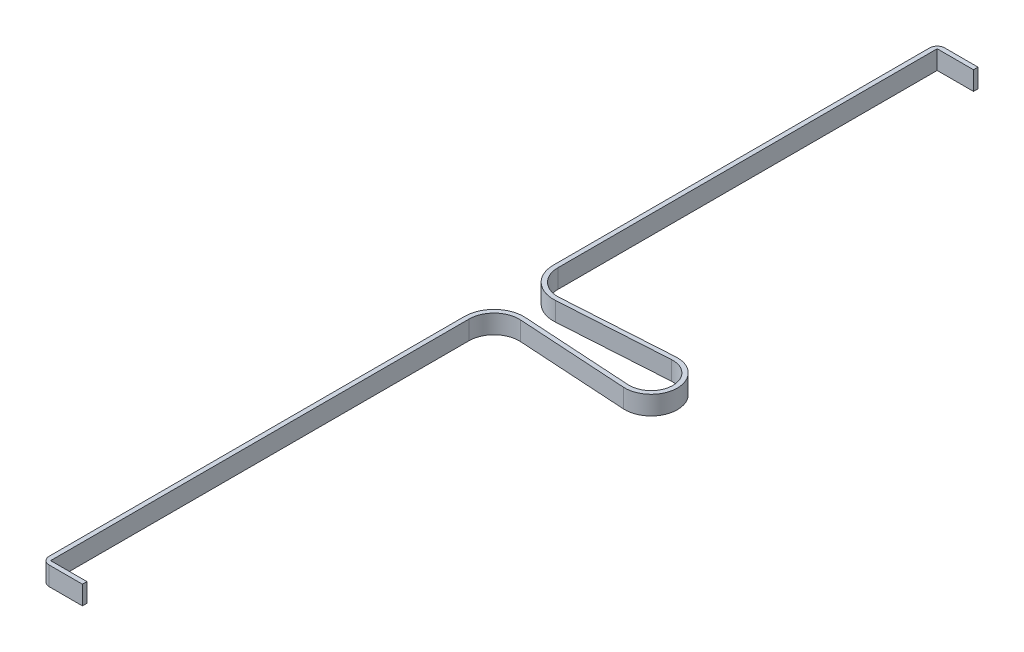
ISO-10303-21;
HEADER;
FILE_DESCRIPTION(('STEP AP214'),'2;1');
FILE_NAME('part.step','',(''),(''),'','','');
FILE_SCHEMA(('AUTOMOTIVE_DESIGN { 1 0 10303 214 1 1 1 1 }'));
ENDSEC;
DATA;
#1=APPLICATION_CONTEXT('core data for automotive mechanical design processes');
#2=APPLICATION_PROTOCOL_DEFINITION('international standard','automotive_design',2000,#1);
#3=PRODUCT_CONTEXT('',#1,'mechanical');
#4=PRODUCT('Part','Part','',(#3));
#5=PRODUCT_RELATED_PRODUCT_CATEGORY('part','',(#4));
#6=PRODUCT_DEFINITION_FORMATION('','',#4);
#7=PRODUCT_DEFINITION_CONTEXT('part definition',#1,'design');
#8=PRODUCT_DEFINITION('design','',#6,#7);
#9=PRODUCT_DEFINITION_SHAPE('','',#8);
#10=(LENGTH_UNIT() NAMED_UNIT(*) SI_UNIT(.MILLI.,.METRE.));
#11=(NAMED_UNIT(*) PLANE_ANGLE_UNIT() SI_UNIT($,.RADIAN.));
#12=(NAMED_UNIT(*) SI_UNIT($,.STERADIAN.) SOLID_ANGLE_UNIT());
#13=UNCERTAINTY_MEASURE_WITH_UNIT(LENGTH_MEASURE(1.E-05),#10,'distance_accuracy_value','');
#14=(GEOMETRIC_REPRESENTATION_CONTEXT(3) GLOBAL_UNCERTAINTY_ASSIGNED_CONTEXT((#13)) GLOBAL_UNIT_ASSIGNED_CONTEXT((#10,
#11,#12)) REPRESENTATION_CONTEXT('',''));
#15=CARTESIAN_POINT('',(0.,0.,0.));
#16=DIRECTION('',(0.,0.,1.));
#17=DIRECTION('',(1.,0.,0.));
#18=AXIS2_PLACEMENT_3D('',#15,#16,#17);
#19=CARTESIAN_POINT('',(35.3046748556602,3.175,-324.600000000124));
#20=DIRECTION('',(1.,0.,0.));
#21=DIRECTION('',(0.,0.,-1.));
#22=AXIS2_PLACEMENT_3D('',#19,#20,#21);
#23=PLANE('',#22);
#24=DIRECTION('',(0.,1.,0.));
#25=VECTOR('',#24,1.);
#26=CARTESIAN_POINT('',(35.3046748556602,3.175,-326.124000000124));
#27=LINE('',#26,#25);
#28=CARTESIAN_POINT('',(35.3046748556602,3.175,-326.124000000124));
#29=VERTEX_POINT('',#28);
#30=CARTESIAN_POINT('',(35.3046748556602,-3.175,-326.124000000124));
#31=VERTEX_POINT('',#30);
#32=EDGE_CURVE('E221',#29,#31,#27,.F.);
#33=ORIENTED_EDGE('',*,*,#32,.F.);
#34=DIRECTION('',(0.,0.,-1.));
#35=VECTOR('',#34,1.);
#36=CARTESIAN_POINT('',(35.3046748556602,3.175,-324.600000000124));
#37=LINE('',#36,#35);
#38=CARTESIAN_POINT('',(35.3046748556602,3.175,-324.600000000124));
#39=VERTEX_POINT('',#38);
#40=EDGE_CURVE('E347',#29,#39,#37,.F.);
#41=ORIENTED_EDGE('',*,*,#40,.T.);
#42=DIRECTION('',(0.,1.,0.));
#43=VECTOR('',#42,1.);
#44=CARTESIAN_POINT('',(35.3046748556602,3.175,-324.600000000124));
#45=LINE('',#44,#43);
#46=CARTESIAN_POINT('',(35.3046748556602,-3.175,-324.600000000124));
#47=VERTEX_POINT('',#46);
#48=EDGE_CURVE('E282',#47,#39,#45,.T.);
#49=ORIENTED_EDGE('',*,*,#48,.F.);
#50=DIRECTION('',(0.,0.,-1.));
#51=VECTOR('',#50,1.);
#52=CARTESIAN_POINT('',(35.3046748556602,-3.175,-324.600000000124));
#53=LINE('',#52,#51);
#54=EDGE_CURVE('E358',#47,#31,#53,.T.);
#55=ORIENTED_EDGE('',*,*,#54,.T.);
#56=EDGE_LOOP('',(#33,#41,#49,#55));
#57=FACE_BOUND('',#56,.T.);
#58=ADVANCED_FACE('F17',(#57),#23,.T.);
#59=CARTESIAN_POINT('',(21.522800000001,-3.175,-324.600000000124));
#60=DIRECTION('',(-1.,0.,0.));
#61=DIRECTION('',(0.,0.,1.));
#62=AXIS2_PLACEMENT_3D('',#59,#60,#61);
#63=PLANE('',#62);
#64=DIRECTION('',(0.,0.,1.));
#65=VECTOR('',#64,1.);
#66=CARTESIAN_POINT('',(21.522800000001,3.175,0.));
#67=LINE('',#66,#65);
#68=CARTESIAN_POINT('',(21.522800000001,3.175,-323.584000000124));
#69=VERTEX_POINT('',#68);
#70=CARTESIAN_POINT('',(21.5228000000048,3.175,-196.600000000001));
#71=VERTEX_POINT('',#70);
#72=EDGE_CURVE('E218',#69,#71,#67,.T.);
#73=ORIENTED_EDGE('',*,*,#72,.F.);
#74=DIRECTION('',(0.,-1.,0.));
#75=VECTOR('',#74,1.);
#76=CARTESIAN_POINT('',(21.522800000001,11.45286,-323.584000000124));
#77=LINE('',#76,#75);
#78=CARTESIAN_POINT('',(21.522800000001,-3.175,-323.584000000124));
#79=VERTEX_POINT('',#78);
#80=EDGE_CURVE('E212',#79,#69,#77,.F.);
#81=ORIENTED_EDGE('',*,*,#80,.F.);
#82=DIRECTION('',(0.,0.,1.));
#83=VECTOR('',#82,1.);
#84=CARTESIAN_POINT('',(21.522800000001,-3.175,0.));
#85=LINE('',#84,#83);
#86=CARTESIAN_POINT('',(21.5228000000048,-3.175,-196.600000000001));
#87=VERTEX_POINT('',#86);
#88=EDGE_CURVE('E215',#79,#87,#85,.T.);
#89=ORIENTED_EDGE('',*,*,#88,.T.);
#90=DIRECTION('',(0.,1.,0.));
#91=VECTOR('',#90,1.);
#92=CARTESIAN_POINT('',(21.5228000000086,-3.175,-196.600000000001));
#93=LINE('',#92,#91);
#94=EDGE_CURVE('E344',#71,#87,#93,.F.);
#95=ORIENTED_EDGE('',*,*,#94,.F.);
#96=EDGE_LOOP('',(#73,#81,#89,#95));
#97=FACE_BOUND('',#96,.T.);
#98=ADVANCED_FACE('F213',(#97),#63,.T.);
#99=CARTESIAN_POINT('',(31.5050000000086,-3.175,-196.600000000001));
#100=DIRECTION('',(0.,1.,0.));
#101=DIRECTION('',(0.,0.,1.));
#102=AXIS2_PLACEMENT_3D('',#99,#100,#101);
#103=CYLINDRICAL_SURFACE('',#102,9.9822);
#104=ORIENTED_EDGE('',*,*,#94,.T.);
#105=CARTESIAN_POINT('',(31.5050000000086,-3.175,-196.600000000001));
#106=DIRECTION('',(0.,1.,0.));
#107=DIRECTION('',(0.,0.,1.));
#108=AXIS2_PLACEMENT_3D('',#105,#106,#107);
#109=CIRCLE('',#108,9.9822);
#110=CARTESIAN_POINT('',(32.1250651510475,-3.175,-186.637076932517));
#111=VERTEX_POINT('',#110);
#112=EDGE_CURVE('E232',#87,#111,#109,.T.);
#113=ORIENTED_EDGE('',*,*,#112,.T.);
#114=DIRECTION('',(0.,1.,0.));
#115=VECTOR('',#114,1.);
#116=CARTESIAN_POINT('',(32.1250651510366,-3.175,-186.637076932516));
#117=LINE('',#116,#115);
#118=CARTESIAN_POINT('',(32.1250651510475,3.175,-186.637076932517));
#119=VERTEX_POINT('',#118);
#120=EDGE_CURVE('E340',#119,#111,#117,.F.);
#121=ORIENTED_EDGE('',*,*,#120,.F.);
#122=CARTESIAN_POINT('',(31.5050000000086,3.175,-196.600000000001));
#123=DIRECTION('',(0.,1.,0.));
#124=DIRECTION('',(0.,0.,1.));
#125=AXIS2_PLACEMENT_3D('',#122,#123,#124);
#126=CIRCLE('',#125,9.9822);
#127=EDGE_CURVE('E400',#71,#119,#126,.T.);
#128=ORIENTED_EDGE('',*,*,#127,.F.);
#129=EDGE_LOOP('',(#104,#113,#121,#128));
#130=FACE_BOUND('',#129,.T.);
#131=ADVANCED_FACE('F613',(#130),#103,.T.);
#132=CARTESIAN_POINT('',(32.1250651510366,-3.175,-186.637076932516));
#133=DIRECTION('',(0.0621170835135079,0.,0.998068869335065));
#134=DIRECTION('',(0.998068869335065,0.,-0.0621170835135079));
#135=AXIS2_PLACEMENT_3D('',#132,#133,#134);
#136=PLANE('',#135);
#137=ORIENTED_EDGE('',*,*,#120,.T.);
#138=DIRECTION('',(0.99806886933506,0.,-0.0621170835135969));
#139=VECTOR('',#138,1.);
#140=CARTESIAN_POINT('',(32.1250651510366,-3.175,-186.637076932516));
#141=LINE('',#140,#139);
#142=CARTESIAN_POINT('',(69.0484840229799,-3.175,-188.935089789295));
#143=VERTEX_POINT('',#142);
#144=EDGE_CURVE('E239',#111,#143,#141,.T.);
#145=ORIENTED_EDGE('',*,*,#144,.T.);
#146=DIRECTION('',(0.,1.,0.));
#147=VECTOR('',#146,1.);
#148=CARTESIAN_POINT('',(69.0484840229734,-3.175,-188.935089789301));
#149=LINE('',#148,#147);
#150=CARTESIAN_POINT('',(69.0484840229799,3.175,-188.935089789295));
#151=VERTEX_POINT('',#150);
#152=EDGE_CURVE('E337',#143,#151,#149,.T.);
#153=ORIENTED_EDGE('',*,*,#152,.T.);
#154=DIRECTION('',(0.99806886933506,0.,-0.0621170835135969));
#155=VECTOR('',#154,1.);
#156=CARTESIAN_POINT('',(32.1250651510366,3.175,-186.637076932516));
#157=LINE('',#156,#155);
#158=EDGE_CURVE('E399',#119,#151,#157,.T.);
#159=ORIENTED_EDGE('',*,*,#158,.F.);
#160=EDGE_LOOP('',(#137,#145,#153,#159));
#161=FACE_BOUND('',#160,.T.);
#162=ADVANCED_FACE('F430',(#161),#136,.T.);
#163=CARTESIAN_POINT('',(69.505000000009,-3.175,-181.60000000001));
#164=DIRECTION('',(0.,1.,0.));
#165=DIRECTION('',(0.,0.,1.));
#166=AXIS2_PLACEMENT_3D('',#163,#164,#165);
#167=CYLINDRICAL_SURFACE('',#166,7.34928221353978);
#168=CARTESIAN_POINT('',(69.505000000009,3.175,-181.60000000001));
#169=DIRECTION('',(0.,1.,0.));
#170=DIRECTION('',(0.,0.,1.));
#171=AXIS2_PLACEMENT_3D('',#168,#169,#170);
#172=CIRCLE('',#171,7.34928221353978);
#173=CARTESIAN_POINT('',(69.0484840229795,3.175,-174.264910210706));
#174=VERTEX_POINT('',#173);
#175=EDGE_CURVE('E395',#151,#174,#172,.F.);
#176=ORIENTED_EDGE('',*,*,#175,.F.);
#177=ORIENTED_EDGE('',*,*,#152,.F.);
#178=CARTESIAN_POINT('',(69.505000000009,-3.175,-181.60000000001));
#179=DIRECTION('',(0.,1.,0.));
#180=DIRECTION('',(0.,0.,1.));
#181=AXIS2_PLACEMENT_3D('',#178,#179,#180);
#182=CIRCLE('',#181,7.34928221353978);
#183=CARTESIAN_POINT('',(69.0484840229795,-3.175,-174.264910210706));
#184=VERTEX_POINT('',#183);
#185=EDGE_CURVE('E421',#143,#184,#182,.F.);
#186=ORIENTED_EDGE('',*,*,#185,.T.);
#187=DIRECTION('',(0.,1.,0.));
#188=VECTOR('',#187,1.);
#189=CARTESIAN_POINT('',(69.0484840229742,-3.175,-174.264910210707));
#190=LINE('',#189,#188);
#191=EDGE_CURVE('E333',#174,#184,#190,.F.);
#192=ORIENTED_EDGE('',*,*,#191,.F.);
#193=EDGE_LOOP('',(#176,#177,#186,#192));
#194=FACE_BOUND('',#193,.T.);
#195=ADVANCED_FACE('F433',(#194),#167,.F.);
#196=CARTESIAN_POINT('',(69.0484840229742,-3.175,-174.264910210707));
#197=DIRECTION('',(0.0621170835135079,0.,-0.998068869335065));
#198=DIRECTION('',(-0.998068869335065,0.,-0.0621170835135079));
#199=AXIS2_PLACEMENT_3D('',#196,#197,#198);
#200=PLANE('',#199);
#201=ORIENTED_EDGE('',*,*,#191,.T.);
#202=DIRECTION('',(-0.99806886933506,0.,-0.0621170835135962));
#203=VECTOR('',#202,1.);
#204=CARTESIAN_POINT('',(69.0484840229742,-3.175,-174.264910210707));
#205=LINE('',#204,#203);
#206=CARTESIAN_POINT('',(32.1250651510473,-3.175,-176.562923067475));
#207=VERTEX_POINT('',#206);
#208=EDGE_CURVE('E420',#184,#207,#205,.T.);
#209=ORIENTED_EDGE('',*,*,#208,.T.);
#210=DIRECTION('',(0.,1.,0.));
#211=VECTOR('',#210,1.);
#212=CARTESIAN_POINT('',(32.1250651510362,-3.175,-176.562923067472));
#213=LINE('',#212,#211);
#214=CARTESIAN_POINT('',(32.1250651510473,3.175,-176.562923067475));
#215=VERTEX_POINT('',#214);
#216=EDGE_CURVE('E329',#215,#207,#213,.F.);
#217=ORIENTED_EDGE('',*,*,#216,.F.);
#218=DIRECTION('',(-0.99806886933506,0.,-0.0621170835135962));
#219=VECTOR('',#218,1.);
#220=CARTESIAN_POINT('',(69.0484840229742,3.175,-174.264910210707));
#221=LINE('',#220,#219);
#222=EDGE_CURVE('E394',#174,#215,#221,.T.);
#223=ORIENTED_EDGE('',*,*,#222,.F.);
#224=EDGE_LOOP('',(#201,#209,#217,#223));
#225=FACE_BOUND('',#224,.T.);
#226=ADVANCED_FACE('F439',(#225),#200,.T.);
#227=CARTESIAN_POINT('',(31.5050000000086,-3.175,-166.599999999994));
#228=DIRECTION('',(0.,1.,0.));
#229=DIRECTION('',(0.,0.,1.));
#230=AXIS2_PLACEMENT_3D('',#227,#228,#229);
#231=CYLINDRICAL_SURFACE('',#230,9.9822);
#232=ORIENTED_EDGE('',*,*,#216,.T.);
#233=CARTESIAN_POINT('',(31.5050000000086,-3.175,-166.599999999994));
#234=DIRECTION('',(0.,1.,0.));
#235=DIRECTION('',(0.,0.,1.));
#236=AXIS2_PLACEMENT_3D('',#233,#234,#235);
#237=CIRCLE('',#236,9.9822);
#238=CARTESIAN_POINT('',(21.522800000001,-3.175,-166.599999999994));
#239=VERTEX_POINT('',#238);
#240=EDGE_CURVE('E417',#207,#239,#237,.T.);
#241=ORIENTED_EDGE('',*,*,#240,.T.);
#242=DIRECTION('',(0.,1.,0.));
#243=VECTOR('',#242,1.);
#244=CARTESIAN_POINT('',(21.522800000001,-3.175,-166.599999999994));
#245=LINE('',#244,#243);
#246=CARTESIAN_POINT('',(21.522800000001,3.175,-166.599999999994));
#247=VERTEX_POINT('',#246);
#248=EDGE_CURVE('E325',#247,#239,#245,.F.);
#249=ORIENTED_EDGE('',*,*,#248,.F.);
#250=CARTESIAN_POINT('',(31.5050000000086,3.175,-166.599999999994));
#251=DIRECTION('',(0.,1.,0.));
#252=DIRECTION('',(0.,0.,1.));
#253=AXIS2_PLACEMENT_3D('',#250,#251,#252);
#254=CIRCLE('',#253,9.9822);
#255=EDGE_CURVE('E390',#215,#247,#254,.T.);
#256=ORIENTED_EDGE('',*,*,#255,.F.);
#257=EDGE_LOOP('',(#232,#241,#249,#256));
#258=FACE_BOUND('',#257,.T.);
#259=ADVANCED_FACE('F443',(#258),#231,.T.);
#260=CARTESIAN_POINT('',(21.522800000001,-3.175,-166.599999999994));
#261=DIRECTION('',(-1.,0.,0.));
#262=DIRECTION('',(0.,0.,1.));
#263=AXIS2_PLACEMENT_3D('',#260,#261,#262);
#264=PLANE('',#263);
#265=DIRECTION('',(0.,0.,1.));
#266=VECTOR('',#265,1.);
#267=CARTESIAN_POINT('',(21.522800000001,-3.175,0.));
#268=LINE('',#267,#266);
#269=CARTESIAN_POINT('',(21.522800000001,-3.175,-26.416));
#270=VERTEX_POINT('',#269);
#271=EDGE_CURVE('E416',#239,#270,#268,.T.);
#272=ORIENTED_EDGE('',*,*,#271,.T.);
#273=DIRECTION('',(0.,-1.,0.));
#274=VECTOR('',#273,1.);
#275=CARTESIAN_POINT('',(21.522800000001,11.45286,-26.416));
#276=LINE('',#275,#274);
#277=CARTESIAN_POINT('',(21.522800000001,3.175,-26.416));
#278=VERTEX_POINT('',#277);
#279=EDGE_CURVE('E321',#278,#270,#276,.T.);
#280=ORIENTED_EDGE('',*,*,#279,.F.);
#281=DIRECTION('',(0.,0.,1.));
#282=VECTOR('',#281,1.);
#283=CARTESIAN_POINT('',(21.522800000001,3.175,0.));
#284=LINE('',#283,#282);
#285=EDGE_CURVE('E389',#247,#278,#284,.T.);
#286=ORIENTED_EDGE('',*,*,#285,.F.);
#287=ORIENTED_EDGE('',*,*,#248,.T.);
#288=EDGE_LOOP('',(#272,#280,#286,#287));
#289=FACE_BOUND('',#288,.T.);
#290=ADVANCED_FACE('F496',(#289),#264,.T.);
#291=CARTESIAN_POINT('',(24.062800000001,11.45286,-26.416));
#292=DIRECTION('',(0.,-1.,0.));
#293=DIRECTION('',(0.,0.,-1.));
#294=AXIS2_PLACEMENT_3D('',#291,#292,#293);
#295=CYLINDRICAL_SURFACE('',#294,2.54);
#296=ORIENTED_EDGE('',*,*,#279,.T.);
#297=CARTESIAN_POINT('',(24.062800000001,-3.175,-26.416));
#298=DIRECTION('',(0.,-1.,0.));
#299=DIRECTION('',(0.,0.,-1.));
#300=AXIS2_PLACEMENT_3D('',#297,#298,#299);
#301=CIRCLE('',#300,2.54);
#302=CARTESIAN_POINT('',(24.062800000001,-3.175,-23.876));
#303=VERTEX_POINT('',#302);
#304=EDGE_CURVE('E413',#270,#303,#301,.F.);
#305=ORIENTED_EDGE('',*,*,#304,.T.);
#306=DIRECTION('',(0.,1.,0.));
#307=VECTOR('',#306,1.);
#308=CARTESIAN_POINT('',(24.062800000001,3.175,-23.876));
#309=LINE('',#308,#307);
#310=CARTESIAN_POINT('',(24.062800000001,3.175,-23.876));
#311=VERTEX_POINT('',#310);
#312=EDGE_CURVE('E307',#311,#303,#309,.F.);
#313=ORIENTED_EDGE('',*,*,#312,.F.);
#314=CARTESIAN_POINT('',(24.062800000001,3.175,-26.416));
#315=DIRECTION('',(0.,-1.,0.));
#316=DIRECTION('',(0.,0.,-1.));
#317=AXIS2_PLACEMENT_3D('',#314,#315,#316);
#318=CIRCLE('',#317,2.54);
#319=EDGE_CURVE('E385',#278,#311,#318,.F.);
#320=ORIENTED_EDGE('',*,*,#319,.F.);
#321=EDGE_LOOP('',(#296,#305,#313,#320));
#322=FACE_BOUND('',#321,.T.);
#323=ADVANCED_FACE('F500',(#322),#295,.T.);
#324=CARTESIAN_POINT('',(21.522800000001,3.175,-23.876));
#325=DIRECTION('',(0.,0.,1.));
#326=DIRECTION('',(1.,0.,0.));
#327=AXIS2_PLACEMENT_3D('',#324,#325,#326);
#328=PLANE('',#327);
#329=DIRECTION('',(1.,0.,0.));
#330=VECTOR('',#329,1.);
#331=CARTESIAN_POINT('',(0.,3.175,-23.876));
#332=LINE('',#331,#330);
#333=CARTESIAN_POINT('',(35.3046748556602,3.175,-23.876));
#334=VERTEX_POINT('',#333);
#335=EDGE_CURVE('E267',#311,#334,#332,.T.);
#336=ORIENTED_EDGE('',*,*,#335,.F.);
#337=ORIENTED_EDGE('',*,*,#312,.T.);
#338=DIRECTION('',(1.,0.,0.));
#339=VECTOR('',#338,1.);
#340=CARTESIAN_POINT('',(0.,-3.175,-23.876));
#341=LINE('',#340,#339);
#342=CARTESIAN_POINT('',(35.3046748556602,-3.175,-23.876));
#343=VERTEX_POINT('',#342);
#344=EDGE_CURVE('E255',#303,#343,#341,.T.);
#345=ORIENTED_EDGE('',*,*,#344,.T.);
#346=DIRECTION('',(0.,1.,0.));
#347=VECTOR('',#346,1.);
#348=CARTESIAN_POINT('',(35.3046748556602,3.175,-23.876));
#349=LINE('',#348,#347);
#350=EDGE_CURVE('E228',#334,#343,#349,.F.);
#351=ORIENTED_EDGE('',*,*,#350,.F.);
#352=EDGE_LOOP('',(#336,#337,#345,#351));
#353=FACE_BOUND('',#352,.T.);
#354=ADVANCED_FACE('F506',(#353),#328,.T.);
#355=CARTESIAN_POINT('',(32.0284176138266,-3.175,-175.041989175647));
#356=DIRECTION('',(-0.0618828608721009,0.,0.998083419124015));
#357=DIRECTION('',(0.998083419124015,0.,0.0618828608721009));
#358=AXIS2_PLACEMENT_3D('',#355,#356,#357);
#359=PLANE('',#358);
#360=DIRECTION('',(0.,1.,0.));
#361=VECTOR('',#360,1.);
#362=CARTESIAN_POINT('',(32.0284176138255,-3.175,-175.041989175629));
#363=LINE('',#362,#361);
#364=CARTESIAN_POINT('',(32.0284176138341,3.175,-175.041989175638));
#365=VERTEX_POINT('',#364);
#366=CARTESIAN_POINT('',(32.0284176138341,-3.175,-175.041989175638));
#367=VERTEX_POINT('',#366);
#368=EDGE_CURVE('E308',#365,#367,#363,.F.);
#369=ORIENTED_EDGE('',*,*,#368,.T.);
#370=DIRECTION('',(0.998083419123981,0.,0.0618828608726443));
#371=VECTOR('',#370,1.);
#372=CARTESIAN_POINT('',(32.0284176138266,-3.175,-175.041989175647));
#373=LINE('',#372,#371);
#374=CARTESIAN_POINT('',(68.9564331915117,-3.175,-172.752389722834));
#375=VERTEX_POINT('',#374);
#376=EDGE_CURVE('E254',#367,#375,#373,.T.);
#377=ORIENTED_EDGE('',*,*,#376,.T.);
#378=DIRECTION('',(0.,1.,0.));
#379=VECTOR('',#378,1.);
#380=CARTESIAN_POINT('',(68.9564331915072,-3.175,-172.752389722844));
#381=LINE('',#380,#379);
#382=CARTESIAN_POINT('',(68.9564331915117,3.175,-172.752389722834));
#383=VERTEX_POINT('',#382);
#384=EDGE_CURVE('E303',#383,#375,#381,.F.);
#385=ORIENTED_EDGE('',*,*,#384,.F.);
#386=DIRECTION('',(0.998083419123981,0.,0.0618828608726443));
#387=VECTOR('',#386,1.);
#388=CARTESIAN_POINT('',(32.0284176138266,3.175,-175.041989175647));
#389=LINE('',#388,#387);
#390=EDGE_CURVE('E381',#365,#383,#389,.T.);
#391=ORIENTED_EDGE('',*,*,#390,.F.);
#392=EDGE_LOOP('',(#369,#377,#385,#391));
#393=FACE_BOUND('',#392,.T.);
#394=ADVANCED_FACE('F560',(#393),#359,.T.);
#395=CARTESIAN_POINT('',(69.505000000009,-3.175,-181.60000000001));
#396=DIRECTION('',(0.,1.,0.));
#397=DIRECTION('',(0.,0.,1.));
#398=AXIS2_PLACEMENT_3D('',#395,#396,#397);
#399=CYLINDRICAL_SURFACE('',#398,8.8646);
#400=ORIENTED_EDGE('',*,*,#384,.T.);
#401=CARTESIAN_POINT('',(69.505000000009,-3.175,-181.60000000001));
#402=DIRECTION('',(0.,1.,0.));
#403=DIRECTION('',(0.,0.,1.));
#404=AXIS2_PLACEMENT_3D('',#401,#402,#403);
#405=CIRCLE('',#404,8.8646);
#406=CARTESIAN_POINT('',(68.9564331915149,-3.175,-190.44761027717));
#407=VERTEX_POINT('',#406);
#408=EDGE_CURVE('E410',#375,#407,#405,.T.);
#409=ORIENTED_EDGE('',*,*,#408,.T.);
#410=DIRECTION('',(0.,1.,0.));
#411=VECTOR('',#410,1.);
#412=CARTESIAN_POINT('',(68.956433191506,-3.175,-190.44761027717));
#413=LINE('',#412,#411);
#414=CARTESIAN_POINT('',(68.9564331915149,3.175,-190.44761027717));
#415=VERTEX_POINT('',#414);
#416=EDGE_CURVE('E299',#415,#407,#413,.F.);
#417=ORIENTED_EDGE('',*,*,#416,.F.);
#418=CARTESIAN_POINT('',(69.505000000009,3.175,-181.60000000001));
#419=DIRECTION('',(0.,1.,0.));
#420=DIRECTION('',(0.,0.,1.));
#421=AXIS2_PLACEMENT_3D('',#418,#419,#420);
#422=CIRCLE('',#421,8.8646);
#423=EDGE_CURVE('E377',#383,#415,#422,.T.);
#424=ORIENTED_EDGE('',*,*,#423,.F.);
#425=EDGE_LOOP('',(#400,#409,#417,#424));
#426=FACE_BOUND('',#425,.T.);
#427=ADVANCED_FACE('F554',(#426),#399,.T.);
#428=CARTESIAN_POINT('',(68.956433191506,-3.175,-190.44761027717));
#429=DIRECTION('',(-0.0618828608721009,0.,-0.998083419124015));
#430=DIRECTION('',(-0.998083419124015,0.,0.0618828608721009));
#431=AXIS2_PLACEMENT_3D('',#428,#429,#430);
#432=PLANE('',#431);
#433=ORIENTED_EDGE('',*,*,#416,.T.);
#434=DIRECTION('',(-0.998083419124024,0.,0.0618828608719605));
#435=VECTOR('',#434,1.);
#436=CARTESIAN_POINT('',(68.956433191506,-3.175,-190.44761027717));
#437=LINE('',#436,#435);
#438=CARTESIAN_POINT('',(32.0284176138312,-3.175,-188.15801082437));
#439=VERTEX_POINT('',#438);
#440=EDGE_CURVE('E409',#407,#439,#437,.T.);
#441=ORIENTED_EDGE('',*,*,#440,.T.);
#442=DIRECTION('',(0.,1.,0.));
#443=VECTOR('',#442,1.);
#444=CARTESIAN_POINT('',(32.0284176138271,-3.175,-188.158010824366));
#445=LINE('',#444,#443);
#446=CARTESIAN_POINT('',(32.0284176138312,3.175,-188.15801082437));
#447=VERTEX_POINT('',#446);
#448=EDGE_CURVE('E283',#439,#447,#445,.T.);
#449=ORIENTED_EDGE('',*,*,#448,.T.);
#450=DIRECTION('',(-0.998083419124024,0.,0.0618828608719605));
#451=VECTOR('',#450,1.);
#452=CARTESIAN_POINT('',(68.956433191506,3.175,-190.44761027717));
#453=LINE('',#452,#451);
#454=EDGE_CURVE('E376',#415,#447,#453,.T.);
#455=ORIENTED_EDGE('',*,*,#454,.F.);
#456=EDGE_LOOP('',(#433,#441,#449,#455));
#457=FACE_BOUND('',#456,.T.);
#458=ADVANCED_FACE('F551',(#457),#432,.T.);
#459=CARTESIAN_POINT('',(31.5050000000086,-3.175,-196.600000000001));
#460=DIRECTION('',(0.,1.,0.));
#461=DIRECTION('',(0.,0.,1.));
#462=AXIS2_PLACEMENT_3D('',#459,#460,#461);
#463=CYLINDRICAL_SURFACE('',#462,8.4582);
#464=CARTESIAN_POINT('',(31.5050000000086,3.175,-196.600000000001));
#465=DIRECTION('',(0.,1.,0.));
#466=DIRECTION('',(0.,0.,1.));
#467=AXIS2_PLACEMENT_3D('',#464,#465,#466);
#468=CIRCLE('',#467,8.4582);
#469=CARTESIAN_POINT('',(23.046800000001,3.175,-196.600000000001));
#470=VERTEX_POINT('',#469);
#471=EDGE_CURVE('E373',#447,#470,#468,.F.);
#472=ORIENTED_EDGE('',*,*,#471,.F.);
#473=ORIENTED_EDGE('',*,*,#448,.F.);
#474=CARTESIAN_POINT('',(31.5050000000086,-3.175,-196.600000000001));
#475=DIRECTION('',(0.,1.,0.));
#476=DIRECTION('',(0.,0.,1.));
#477=AXIS2_PLACEMENT_3D('',#474,#475,#476);
#478=CIRCLE('',#477,8.4582);
#479=CARTESIAN_POINT('',(23.046800000001,-3.175,-196.600000000001));
#480=VERTEX_POINT('',#479);
#481=EDGE_CURVE('E406',#439,#480,#478,.F.);
#482=ORIENTED_EDGE('',*,*,#481,.T.);
#483=DIRECTION('',(0.,1.,0.));
#484=VECTOR('',#483,1.);
#485=CARTESIAN_POINT('',(23.046800000001,-3.175,-196.600000000001));
#486=LINE('',#485,#484);
#487=EDGE_CURVE('E278',#470,#480,#486,.F.);
#488=ORIENTED_EDGE('',*,*,#487,.F.);
#489=EDGE_LOOP('',(#472,#473,#482,#488));
#490=FACE_BOUND('',#489,.T.);
#491=ADVANCED_FACE('F548',(#490),#463,.F.);
#492=CARTESIAN_POINT('',(23.046800000001,-3.175,-196.600000000001));
#493=DIRECTION('',(1.,0.,0.));
#494=DIRECTION('',(0.,0.,-1.));
#495=AXIS2_PLACEMENT_3D('',#492,#493,#494);
#496=PLANE('',#495);
#497=DIRECTION('',(0.,0.,1.));
#498=VECTOR('',#497,1.);
#499=CARTESIAN_POINT('',(23.046800000001,-3.175,0.));
#500=LINE('',#499,#498);
#501=CARTESIAN_POINT('',(23.046800000001,-3.175,-324.600000000124));
#502=VERTEX_POINT('',#501);
#503=EDGE_CURVE('E353',#480,#502,#500,.F.);
#504=ORIENTED_EDGE('',*,*,#503,.T.);
#505=DIRECTION('',(0.,1.,0.));
#506=VECTOR('',#505,1.);
#507=CARTESIAN_POINT('',(23.046800000001,3.175,-324.600000000124));
#508=LINE('',#507,#506);
#509=CARTESIAN_POINT('',(23.046800000001,3.175,-324.600000000124));
#510=VERTEX_POINT('',#509);
#511=EDGE_CURVE('E275',#510,#502,#508,.F.);
#512=ORIENTED_EDGE('',*,*,#511,.F.);
#513=DIRECTION('',(0.,0.,1.));
#514=VECTOR('',#513,1.);
#515=CARTESIAN_POINT('',(23.046800000001,3.175,0.));
#516=LINE('',#515,#514);
#517=EDGE_CURVE('E289',#470,#510,#516,.F.);
#518=ORIENTED_EDGE('',*,*,#517,.F.);
#519=ORIENTED_EDGE('',*,*,#487,.T.);
#520=EDGE_LOOP('',(#504,#512,#518,#519));
#521=FACE_BOUND('',#520,.T.);
#522=ADVANCED_FACE('F541',(#521),#496,.T.);
#523=CARTESIAN_POINT('',(21.522800000001,3.175,-324.600000000124));
#524=DIRECTION('',(0.,0.,1.));
#525=DIRECTION('',(1.,0.,0.));
#526=AXIS2_PLACEMENT_3D('',#523,#524,#525);
#527=PLANE('',#526);
#528=DIRECTION('',(1.,0.,0.));
#529=VECTOR('',#528,1.);
#530=CARTESIAN_POINT('',(0.,3.175,-324.600000000124));
#531=LINE('',#530,#529);
#532=EDGE_CURVE('E284',#510,#39,#531,.T.);
#533=ORIENTED_EDGE('',*,*,#532,.F.);
#534=ORIENTED_EDGE('',*,*,#511,.T.);
#535=DIRECTION('',(1.,0.,0.));
#536=VECTOR('',#535,1.);
#537=CARTESIAN_POINT('',(0.,-3.175,-324.600000000124));
#538=LINE('',#537,#536);
#539=EDGE_CURVE('E348',#502,#47,#538,.T.);
#540=ORIENTED_EDGE('',*,*,#539,.T.);
#541=ORIENTED_EDGE('',*,*,#48,.T.);
#542=EDGE_LOOP('',(#533,#534,#540,#541));
#543=FACE_BOUND('',#542,.T.);
#544=ADVANCED_FACE('F538',(#543),#527,.T.);
#545=CARTESIAN_POINT('',(35.3046748556602,3.175,-326.124000000124));
#546=DIRECTION('',(0.,0.,-1.));
#547=DIRECTION('',(-1.,0.,0.));
#548=AXIS2_PLACEMENT_3D('',#545,#546,#547);
#549=PLANE('',#548);
#550=DIRECTION('',(1.,0.,0.));
#551=VECTOR('',#550,1.);
#552=CARTESIAN_POINT('',(0.,-3.175,-326.124000000124));
#553=LINE('',#552,#551);
#554=CARTESIAN_POINT('',(24.062800000001,-3.175,-326.124000000124));
#555=VERTEX_POINT('',#554);
#556=EDGE_CURVE('E352',#31,#555,#553,.F.);
#557=ORIENTED_EDGE('',*,*,#556,.T.);
#558=DIRECTION('',(0.,-1.,0.));
#559=VECTOR('',#558,1.);
#560=CARTESIAN_POINT('',(24.062800000001,11.45286,-326.124000000124));
#561=LINE('',#560,#559);
#562=CARTESIAN_POINT('',(24.062800000001,3.175,-326.124000000124));
#563=VERTEX_POINT('',#562);
#564=EDGE_CURVE('E207',#563,#555,#561,.T.);
#565=ORIENTED_EDGE('',*,*,#564,.F.);
#566=DIRECTION('',(1.,0.,0.));
#567=VECTOR('',#566,1.);
#568=CARTESIAN_POINT('',(0.,3.175,-326.124000000124));
#569=LINE('',#568,#567);
#570=EDGE_CURVE('E288',#29,#563,#569,.F.);
#571=ORIENTED_EDGE('',*,*,#570,.F.);
#572=ORIENTED_EDGE('',*,*,#32,.T.);
#573=EDGE_LOOP('',(#557,#565,#571,#572));
#574=FACE_BOUND('',#573,.T.);
#575=ADVANCED_FACE('F531',(#574),#549,.T.);
#576=CARTESIAN_POINT('',(24.062800000001,11.45286,-323.584000000124));
#577=DIRECTION('',(0.,-1.,0.));
#578=DIRECTION('',(0.,0.,-1.));
#579=AXIS2_PLACEMENT_3D('',#576,#577,#578);
#580=CYLINDRICAL_SURFACE('',#579,2.54);
#581=ORIENTED_EDGE('',*,*,#564,.T.);
#582=CARTESIAN_POINT('',(24.062800000001,-3.175,-323.584000000124));
#583=DIRECTION('',(0.,-1.,0.));
#584=DIRECTION('',(0.,0.,-1.));
#585=AXIS2_PLACEMENT_3D('',#582,#583,#584);
#586=CIRCLE('',#585,2.54);
#587=EDGE_CURVE('E20',#555,#79,#586,.F.);
#588=ORIENTED_EDGE('',*,*,#587,.T.);
#589=ORIENTED_EDGE('',*,*,#80,.T.);
#590=CARTESIAN_POINT('',(24.062800000001,3.175,-323.584000000124));
#591=DIRECTION('',(0.,-1.,0.));
#592=DIRECTION('',(0.,0.,-1.));
#593=AXIS2_PLACEMENT_3D('',#590,#591,#592);
#594=CIRCLE('',#593,2.54);
#595=EDGE_CURVE('E370',#563,#69,#594,.F.);
#596=ORIENTED_EDGE('',*,*,#595,.F.);
#597=EDGE_LOOP('',(#581,#588,#589,#596));
#598=FACE_BOUND('',#597,.T.);
#599=ADVANCED_FACE('F224',(#598),#580,.T.);
#600=CARTESIAN_POINT('',(35.3046748556602,3.175,-23.876));
#601=DIRECTION('',(1.,0.,0.));
#602=DIRECTION('',(0.,0.,-1.));
#603=AXIS2_PLACEMENT_3D('',#600,#601,#602);
#604=PLANE('',#603);
#605=DIRECTION('',(0.,1.,0.));
#606=VECTOR('',#605,1.);
#607=CARTESIAN_POINT('',(35.3046748556602,3.175,-25.4));
#608=LINE('',#607,#606);
#609=CARTESIAN_POINT('',(35.3046748556602,3.175,-25.4));
#610=VERTEX_POINT('',#609);
#611=CARTESIAN_POINT('',(35.3046748556602,-3.175,-25.4));
#612=VERTEX_POINT('',#611);
#613=EDGE_CURVE('E248',#610,#612,#608,.F.);
#614=ORIENTED_EDGE('',*,*,#613,.F.);
#615=DIRECTION('',(0.,0.,1.));
#616=VECTOR('',#615,1.);
#617=CARTESIAN_POINT('',(35.3046748556602,3.175,0.));
#618=LINE('',#617,#616);
#619=EDGE_CURVE('E263',#334,#610,#618,.F.);
#620=ORIENTED_EDGE('',*,*,#619,.F.);
#621=ORIENTED_EDGE('',*,*,#350,.T.);
#622=DIRECTION('',(0.,0.,1.));
#623=VECTOR('',#622,1.);
#624=CARTESIAN_POINT('',(35.3046748556602,-3.175,0.));
#625=LINE('',#624,#623);
#626=EDGE_CURVE('E251',#343,#612,#625,.F.);
#627=ORIENTED_EDGE('',*,*,#626,.T.);
#628=EDGE_LOOP('',(#614,#620,#621,#627));
#629=FACE_BOUND('',#628,.T.);
#630=ADVANCED_FACE('F510',(#629),#604,.T.);
#631=CARTESIAN_POINT('',(0.,-3.175,0.));
#632=DIRECTION('',(0.,1.,0.));
#633=DIRECTION('',(0.,0.,1.));
#634=AXIS2_PLACEMENT_3D('',#631,#632,#633);
#635=PLANE('',#634);
#636=ORIENTED_EDGE('',*,*,#54,.F.);
#637=ORIENTED_EDGE('',*,*,#539,.F.);
#638=ORIENTED_EDGE('',*,*,#503,.F.);
#639=ORIENTED_EDGE('',*,*,#481,.F.);
#640=ORIENTED_EDGE('',*,*,#440,.F.);
#641=ORIENTED_EDGE('',*,*,#408,.F.);
#642=ORIENTED_EDGE('',*,*,#376,.F.);
#643=CARTESIAN_POINT('',(31.5050000000086,-3.175,-166.599999999994));
#644=DIRECTION('',(0.,1.,0.));
#645=DIRECTION('',(0.,0.,1.));
#646=AXIS2_PLACEMENT_3D('',#643,#644,#645);
#647=CIRCLE('',#646,8.4582);
#648=CARTESIAN_POINT('',(23.046800000001,-3.175,-166.599999999994));
#649=VERTEX_POINT('',#648);
#650=EDGE_CURVE('E312',#367,#649,#647,.T.);
#651=ORIENTED_EDGE('',*,*,#650,.T.);
#652=DIRECTION('',(0.,0.,-1.));
#653=VECTOR('',#652,1.);
#654=CARTESIAN_POINT('',(23.046800000001,-3.175,-25.4));
#655=LINE('',#654,#653);
#656=CARTESIAN_POINT('',(23.046800000001,-3.175,-25.4));
#657=VERTEX_POINT('',#656);
#658=EDGE_CURVE('E247',#657,#649,#655,.T.);
#659=ORIENTED_EDGE('',*,*,#658,.F.);
#660=DIRECTION('',(-1.,0.,0.));
#661=VECTOR('',#660,1.);
#662=CARTESIAN_POINT('',(35.3046748556602,-3.175,-25.4));
#663=LINE('',#662,#661);
#664=EDGE_CURVE('E243',#612,#657,#663,.T.);
#665=ORIENTED_EDGE('',*,*,#664,.F.);
#666=ORIENTED_EDGE('',*,*,#626,.F.);
#667=ORIENTED_EDGE('',*,*,#344,.F.);
#668=ORIENTED_EDGE('',*,*,#304,.F.);
#669=ORIENTED_EDGE('',*,*,#271,.F.);
#670=ORIENTED_EDGE('',*,*,#240,.F.);
#671=ORIENTED_EDGE('',*,*,#208,.F.);
#672=ORIENTED_EDGE('',*,*,#185,.F.);
#673=ORIENTED_EDGE('',*,*,#144,.F.);
#674=ORIENTED_EDGE('',*,*,#112,.F.);
#675=ORIENTED_EDGE('',*,*,#88,.F.);
#676=ORIENTED_EDGE('',*,*,#587,.F.);
#677=ORIENTED_EDGE('',*,*,#556,.F.);
#678=EDGE_LOOP('',(#636,#637,#638,#639,#640,#641,#642,#651,#659,#665,#666,#667,#668,#669,#670,
#671,#672,#673,#674,#675,#676,#677));
#679=FACE_BOUND('',#678,.T.);
#680=ADVANCED_FACE('F230',(#679),#635,.F.);
#681=CARTESIAN_POINT('',(31.5050000000086,-3.175,-166.599999999994));
#682=DIRECTION('',(0.,1.,0.));
#683=DIRECTION('',(0.,0.,1.));
#684=AXIS2_PLACEMENT_3D('',#681,#682,#683);
#685=CYLINDRICAL_SURFACE('',#684,8.4582);
#686=CARTESIAN_POINT('',(31.5050000000086,3.175,-166.599999999994));
#687=DIRECTION('',(0.,1.,0.));
#688=DIRECTION('',(0.,0.,1.));
#689=AXIS2_PLACEMENT_3D('',#686,#687,#688);
#690=CIRCLE('',#689,8.4582);
#691=CARTESIAN_POINT('',(23.046800000001,3.175,-166.599999999994));
#692=VERTEX_POINT('',#691);
#693=EDGE_CURVE('E266',#692,#365,#690,.F.);
#694=ORIENTED_EDGE('',*,*,#693,.F.);
#695=DIRECTION('',(0.,1.,0.));
#696=VECTOR('',#695,1.);
#697=CARTESIAN_POINT('',(23.046800000001,-3.175,-166.599999999994));
#698=LINE('',#697,#696);
#699=EDGE_CURVE('E459',#649,#692,#698,.T.);
#700=ORIENTED_EDGE('',*,*,#699,.F.);
#701=ORIENTED_EDGE('',*,*,#650,.F.);
#702=ORIENTED_EDGE('',*,*,#368,.F.);
#703=EDGE_LOOP('',(#694,#700,#701,#702));
#704=FACE_BOUND('',#703,.T.);
#705=ADVANCED_FACE('F562',(#704),#685,.F.);
#706=CARTESIAN_POINT('',(0.,3.175,0.));
#707=DIRECTION('',(0.,1.,0.));
#708=DIRECTION('',(0.,0.,1.));
#709=AXIS2_PLACEMENT_3D('',#706,#707,#708);
#710=PLANE('',#709);
#711=ORIENTED_EDGE('',*,*,#570,.T.);
#712=ORIENTED_EDGE('',*,*,#595,.T.);
#713=ORIENTED_EDGE('',*,*,#72,.T.);
#714=ORIENTED_EDGE('',*,*,#127,.T.);
#715=ORIENTED_EDGE('',*,*,#158,.T.);
#716=ORIENTED_EDGE('',*,*,#175,.T.);
#717=ORIENTED_EDGE('',*,*,#222,.T.);
#718=ORIENTED_EDGE('',*,*,#255,.T.);
#719=ORIENTED_EDGE('',*,*,#285,.T.);
#720=ORIENTED_EDGE('',*,*,#319,.T.);
#721=ORIENTED_EDGE('',*,*,#335,.T.);
#722=ORIENTED_EDGE('',*,*,#619,.T.);
#723=DIRECTION('',(-1.,0.,0.));
#724=VECTOR('',#723,1.);
#725=CARTESIAN_POINT('',(35.3046748556602,3.175,-25.4));
#726=LINE('',#725,#724);
#727=CARTESIAN_POINT('',(23.046800000001,3.175,-25.4));
#728=VERTEX_POINT('',#727);
#729=EDGE_CURVE('E40',#728,#610,#726,.F.);
#730=ORIENTED_EDGE('',*,*,#729,.F.);
#731=DIRECTION('',(0.,0.,-1.));
#732=VECTOR('',#731,1.);
#733=CARTESIAN_POINT('',(23.046800000001,3.175,-25.4));
#734=LINE('',#733,#732);
#735=EDGE_CURVE('E27',#692,#728,#734,.F.);
#736=ORIENTED_EDGE('',*,*,#735,.F.);
#737=ORIENTED_EDGE('',*,*,#693,.T.);
#738=ORIENTED_EDGE('',*,*,#390,.T.);
#739=ORIENTED_EDGE('',*,*,#423,.T.);
#740=ORIENTED_EDGE('',*,*,#454,.T.);
#741=ORIENTED_EDGE('',*,*,#471,.T.);
#742=ORIENTED_EDGE('',*,*,#517,.T.);
#743=ORIENTED_EDGE('',*,*,#532,.T.);
#744=ORIENTED_EDGE('',*,*,#40,.F.);
#745=EDGE_LOOP('',(#711,#712,#713,#714,#715,#716,#717,#718,#719,#720,#721,#722,#730,#736,#737,
#738,#739,#740,#741,#742,#743,#744));
#746=FACE_BOUND('',#745,.T.);
#747=ADVANCED_FACE('F448',(#746),#710,.T.);
#748=CARTESIAN_POINT('',(35.3046748556602,3.175,-25.4));
#749=DIRECTION('',(0.,0.,-1.));
#750=DIRECTION('',(-1.,0.,0.));
#751=AXIS2_PLACEMENT_3D('',#748,#749,#750);
#752=PLANE('',#751);
#753=ORIENTED_EDGE('',*,*,#664,.T.);
#754=DIRECTION('',(0.,1.,0.));
#755=VECTOR('',#754,1.);
#756=CARTESIAN_POINT('',(23.046800000001,-3.175,-25.4));
#757=LINE('',#756,#755);
#758=EDGE_CURVE('E11',#728,#657,#757,.F.);
#759=ORIENTED_EDGE('',*,*,#758,.F.);
#760=ORIENTED_EDGE('',*,*,#729,.T.);
#761=ORIENTED_EDGE('',*,*,#613,.T.);
#762=EDGE_LOOP('',(#753,#759,#760,#761));
#763=FACE_BOUND('',#762,.T.);
#764=ADVANCED_FACE('F567',(#763),#752,.T.);
#765=CARTESIAN_POINT('',(23.046800000001,-3.175,-25.4));
#766=DIRECTION('',(1.,0.,0.));
#767=DIRECTION('',(0.,0.,-1.));
#768=AXIS2_PLACEMENT_3D('',#765,#766,#767);
#769=PLANE('',#768);
#770=ORIENTED_EDGE('',*,*,#735,.T.);
#771=ORIENTED_EDGE('',*,*,#758,.T.);
#772=ORIENTED_EDGE('',*,*,#658,.T.);
#773=ORIENTED_EDGE('',*,*,#699,.T.);
#774=EDGE_LOOP('',(#770,#771,#772,#773));
#775=FACE_BOUND('',#774,.T.);
#776=ADVANCED_FACE('F564',(#775),#769,.T.);
#777=CLOSED_SHELL('',(#58,#98,#131,#162,#195,#226,#259,#290,#323,#354,#394,#427,#458,#491,#522,
#544,#575,#599,#630,#680,#705,#747,#764,#776));
#778=MANIFOLD_SOLID_BREP('B1',#777);
#779=ADVANCED_BREP_SHAPE_REPRESENTATION('',(#18,#778),#14);
#780=SHAPE_DEFINITION_REPRESENTATION(#9,#779);
ENDSEC;
END-ISO-10303-21;
